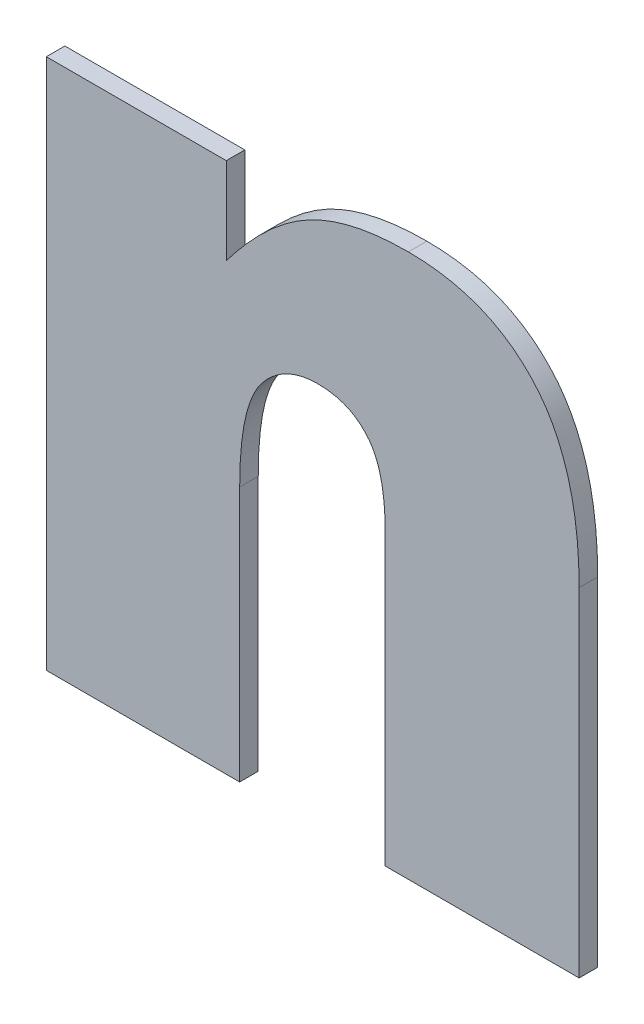
ISO-10303-21;
HEADER;
FILE_DESCRIPTION(('STEP AP214'),'2;1');
FILE_NAME('part.step','',(''),(''),'','','');
FILE_SCHEMA(('AUTOMOTIVE_DESIGN { 1 0 10303 214 1 1 1 1 }'));
ENDSEC;
DATA;
#1=APPLICATION_CONTEXT('core data for automotive mechanical design processes');
#2=APPLICATION_PROTOCOL_DEFINITION('international standard','automotive_design',2000,#1);
#3=PRODUCT_CONTEXT('',#1,'mechanical');
#4=PRODUCT('Part','Part','',(#3));
#5=PRODUCT_RELATED_PRODUCT_CATEGORY('part','',(#4));
#6=PRODUCT_DEFINITION_FORMATION('','',#4);
#7=PRODUCT_DEFINITION_CONTEXT('part definition',#1,'design');
#8=PRODUCT_DEFINITION('design','',#6,#7);
#9=PRODUCT_DEFINITION_SHAPE('','',#8);
#10=(LENGTH_UNIT() NAMED_UNIT(*) SI_UNIT(.MILLI.,.METRE.));
#11=(NAMED_UNIT(*) PLANE_ANGLE_UNIT() SI_UNIT($,.RADIAN.));
#12=(NAMED_UNIT(*) SI_UNIT($,.STERADIAN.) SOLID_ANGLE_UNIT());
#13=UNCERTAINTY_MEASURE_WITH_UNIT(LENGTH_MEASURE(1.E-05),#10,'distance_accuracy_value','');
#14=(GEOMETRIC_REPRESENTATION_CONTEXT(3) GLOBAL_UNCERTAINTY_ASSIGNED_CONTEXT((#13)) GLOBAL_UNIT_ASSIGNED_CONTEXT((#10,
#11,#12)) REPRESENTATION_CONTEXT('',''));
#15=CARTESIAN_POINT('',(0.,0.,0.));
#16=DIRECTION('',(0.,0.,1.));
#17=DIRECTION('',(1.,0.,0.));
#18=AXIS2_PLACEMENT_3D('',#15,#16,#17);
#19=CARTESIAN_POINT('',(0.587675625881754,-0.660492593100787,0.));
#20=CARTESIAN_POINT('',(0.587675625881754,-0.660492593100787,0.003));
#21=CARTESIAN_POINT('',(0.592810563257037,-0.660492569714139,0.));
#22=CARTESIAN_POINT('',(0.592810563257037,-0.660492569714139,0.003));
#23=CARTESIAN_POINT('',(0.598516079892155,-0.667225017176646,0.));
#24=CARTESIAN_POINT('',(0.598516079892155,-0.667225017176646,0.003));
#25=CARTESIAN_POINT('',(0.598516049229844,-0.675326856629752,0.));
#26=CARTESIAN_POINT('',(0.598516049229844,-0.675326856629752,0.003));
#27=B_SPLINE_SURFACE_WITH_KNOTS('',2,1,((#19,#20),(#21,#22),(#23,#24),(#25,#26)),.UNSPECIFIED.,
.F.,.F.,.F.,(3,1,3),(2,2),(-2.,-1.,0.),(0.,0.0003),.UNSPECIFIED.);
#28=CARTESIAN_POINT('',(0.587675625881754,-0.660492593100787,0.));
#29=CARTESIAN_POINT('',(0.592810563257037,-0.660492569714139,0.));
#30=CARTESIAN_POINT('',(0.598516079892155,-0.667225017176646,0.));
#31=CARTESIAN_POINT('',(0.598516049229844,-0.675326856629752,0.));
#32=B_SPLINE_CURVE_WITH_KNOTS('',2,(#28,#29,#30,#31),.UNSPECIFIED.,.F.,.F.,(3,1,3),(-2.,-1.,0.),.UNSPECIFIED.);
#33=CARTESIAN_POINT('',(0.587675625881754,-0.660492593100787,0.));
#34=VERTEX_POINT('',#33);
#35=CARTESIAN_POINT('',(0.598516049229844,-0.675326856629752,0.));
#36=VERTEX_POINT('',#35);
#37=EDGE_CURVE('E11',#34,#36,#32,.T.);
#38=DIRECTION('',(0.,0.,1.));
#39=VECTOR('',#38,1.);
#40=CARTESIAN_POINT('',(0.598516049229844,-0.675326856629752,0.));
#41=LINE('',#40,#39);
#42=CARTESIAN_POINT('',(0.598516049229844,-0.675326856629752,0.003));
#43=VERTEX_POINT('',#42);
#44=EDGE_CURVE('E28',#36,#43,#41,.T.);
#45=CARTESIAN_POINT('',(0.587675625881754,-0.660492593100787,0.003));
#46=CARTESIAN_POINT('',(0.592810563257037,-0.660492569714139,0.003));
#47=CARTESIAN_POINT('',(0.598516079892155,-0.667225017176646,0.003));
#48=CARTESIAN_POINT('',(0.598516049229844,-0.675326856629752,0.003));
#49=B_SPLINE_CURVE_WITH_KNOTS('',2,(#45,#46,#47,#48),.UNSPECIFIED.,.F.,.F.,(3,1,3),(-2.,-1.,0.),.UNSPECIFIED.);
#50=CARTESIAN_POINT('',(0.587675625881754,-0.660492593100787,0.003));
#51=VERTEX_POINT('',#50);
#52=EDGE_CURVE('E128',#51,#43,#49,.T.);
#53=DIRECTION('',(0.,0.,1.));
#54=VECTOR('',#53,1.);
#55=CARTESIAN_POINT('',(0.587675625881754,-0.660492593100787,0.));
#56=LINE('',#55,#54);
#57=EDGE_CURVE('E237',#34,#51,#56,.T.);
#58=ORIENTED_EDGE('',*,*,#37,.T.);
#59=ORIENTED_EDGE('',*,*,#44,.T.);
#60=ORIENTED_EDGE('',*,*,#52,.F.);
#61=ORIENTED_EDGE('',*,*,#57,.F.);
#62=EDGE_LOOP('',(#58,#59,#60,#61));
#63=FACE_BOUND('',#62,.T.);
#64=ADVANCED_FACE('F17',(#63),#27,.T.);
#65=CARTESIAN_POINT('',(0.575009447022407,-0.68126056204134,0.));
#66=CARTESIAN_POINT('',(0.575009447022407,-0.68126056204134,0.003));
#67=CARTESIAN_POINT('',(0.575009447022364,-0.669507260937635,0.));
#68=CARTESIAN_POINT('',(0.575009447022364,-0.669507260937635,0.003));
#69=CARTESIAN_POINT('',(0.58208424962848,-0.660492593100778,0.));
#70=CARTESIAN_POINT('',(0.58208424962848,-0.660492593100778,0.003));
#71=CARTESIAN_POINT('',(0.587675625881754,-0.660492593100787,0.));
#72=CARTESIAN_POINT('',(0.587675625881754,-0.660492593100787,0.003));
#73=B_SPLINE_SURFACE_WITH_KNOTS('',2,1,((#65,#66),(#67,#68),(#69,#70),(#71,#72)),.UNSPECIFIED.,
.F.,.F.,.F.,(3,1,3),(2,2),(-2.,-1.,0.),(0.,0.0003),.UNSPECIFIED.);
#74=CARTESIAN_POINT('',(0.575009447022407,-0.68126056204134,0.));
#75=CARTESIAN_POINT('',(0.575009447022364,-0.669507260937635,0.));
#76=CARTESIAN_POINT('',(0.58208424962848,-0.660492593100778,0.));
#77=CARTESIAN_POINT('',(0.587675625881754,-0.660492593100787,0.));
#78=B_SPLINE_CURVE_WITH_KNOTS('',2,(#74,#75,#76,#77),.UNSPECIFIED.,.F.,.F.,(3,1,3),(-2.,-1.,0.),.UNSPECIFIED.);
#79=CARTESIAN_POINT('',(0.575009447022407,-0.68126056204134,0.));
#80=VERTEX_POINT('',#79);
#81=EDGE_CURVE('E229',#80,#34,#78,.T.);
#82=CARTESIAN_POINT('',(0.575009447022407,-0.68126056204134,0.003));
#83=CARTESIAN_POINT('',(0.575009447022364,-0.669507260937635,0.003));
#84=CARTESIAN_POINT('',(0.58208424962848,-0.660492593100778,0.003));
#85=CARTESIAN_POINT('',(0.587675625881754,-0.660492593100787,0.003));
#86=B_SPLINE_CURVE_WITH_KNOTS('',2,(#82,#83,#84,#85),.UNSPECIFIED.,.F.,.F.,(3,1,3),(-2.,-1.,0.),.UNSPECIFIED.);
#87=CARTESIAN_POINT('',(0.575009447022407,-0.68126056204134,0.003));
#88=VERTEX_POINT('',#87);
#89=EDGE_CURVE('E225',#88,#51,#86,.T.);
#90=DIRECTION('',(0.,0.,1.));
#91=VECTOR('',#90,1.);
#92=CARTESIAN_POINT('',(0.575009447022407,-0.68126056204134,0.));
#93=LINE('',#92,#91);
#94=EDGE_CURVE('E222',#80,#88,#93,.T.);
#95=ORIENTED_EDGE('',*,*,#81,.T.);
#96=ORIENTED_EDGE('',*,*,#57,.T.);
#97=ORIENTED_EDGE('',*,*,#89,.F.);
#98=ORIENTED_EDGE('',*,*,#94,.F.);
#99=EDGE_LOOP('',(#95,#96,#97,#98));
#100=FACE_BOUND('',#99,.T.);
#101=ADVANCED_FACE('F274',(#100),#73,.T.);
#102=CARTESIAN_POINT('',(0.575009447022407,-0.722568280483534,0.));
#103=DIRECTION('',(1.,0.,0.));
#104=DIRECTION('',(0.,1.,0.));
#105=AXIS2_PLACEMENT_3D('',#102,#103,#104);
#106=PLANE('',#105);
#107=DIRECTION('',(0.,1.,0.));
#108=VECTOR('',#107,1.);
#109=CARTESIAN_POINT('',(0.575009447022407,-0.722568280483534,0.));
#110=LINE('',#109,#108);
#111=CARTESIAN_POINT('',(0.575009447022407,-0.722568280483534,0.));
#112=VERTEX_POINT('',#111);
#113=EDGE_CURVE('E219',#112,#80,#110,.T.);
#114=ORIENTED_EDGE('',*,*,#113,.T.);
#115=ORIENTED_EDGE('',*,*,#94,.T.);
#116=DIRECTION('',(0.,1.,0.));
#117=VECTOR('',#116,1.);
#118=CARTESIAN_POINT('',(0.575009447022407,-0.722568280483534,0.003));
#119=LINE('',#118,#117);
#120=CARTESIAN_POINT('',(0.575009447022407,-0.722568280483534,0.003));
#121=VERTEX_POINT('',#120);
#122=EDGE_CURVE('E216',#121,#88,#119,.T.);
#123=ORIENTED_EDGE('',*,*,#122,.F.);
#124=DIRECTION('',(0.,0.,1.));
#125=VECTOR('',#124,1.);
#126=CARTESIAN_POINT('',(0.575009447022407,-0.722568280483534,0.));
#127=LINE('',#126,#125);
#128=EDGE_CURVE('E213',#112,#121,#127,.T.);
#129=ORIENTED_EDGE('',*,*,#128,.F.);
#130=EDGE_LOOP('',(#114,#115,#123,#129));
#131=FACE_BOUND('',#130,.T.);
#132=ADVANCED_FACE('F271',(#131),#106,.T.);
#133=CARTESIAN_POINT('',(0.543743383892126,-0.722568280483534,0.));
#134=DIRECTION('',(0.,-1.,0.));
#135=DIRECTION('',(1.,0.,0.));
#136=AXIS2_PLACEMENT_3D('',#133,#134,#135);
#137=PLANE('',#136);
#138=DIRECTION('',(1.,0.,0.));
#139=VECTOR('',#138,1.);
#140=CARTESIAN_POINT('',(0.543743383892126,-0.722568280483534,0.));
#141=LINE('',#140,#139);
#142=CARTESIAN_POINT('',(0.543743383892126,-0.722568280483534,0.));
#143=VERTEX_POINT('',#142);
#144=EDGE_CURVE('E210',#143,#112,#141,.T.);
#145=ORIENTED_EDGE('',*,*,#144,.T.);
#146=ORIENTED_EDGE('',*,*,#128,.T.);
#147=DIRECTION('',(1.,0.,0.));
#148=VECTOR('',#147,1.);
#149=CARTESIAN_POINT('',(0.543743383892126,-0.722568280483534,0.003));
#150=LINE('',#149,#148);
#151=CARTESIAN_POINT('',(0.543743383892126,-0.722568280483534,0.003));
#152=VERTEX_POINT('',#151);
#153=EDGE_CURVE('E207',#152,#121,#150,.T.);
#154=ORIENTED_EDGE('',*,*,#153,.F.);
#155=DIRECTION('',(0.,0.,1.));
#156=VECTOR('',#155,1.);
#157=CARTESIAN_POINT('',(0.543743383892126,-0.722568280483534,0.));
#158=LINE('',#157,#156);
#159=EDGE_CURVE('E204',#143,#152,#158,.T.);
#160=ORIENTED_EDGE('',*,*,#159,.F.);
#161=EDGE_LOOP('',(#145,#146,#154,#160));
#162=FACE_BOUND('',#161,.T.);
#163=ADVANCED_FACE('F268',(#162),#137,.T.);
#164=CARTESIAN_POINT('',(0.543743383892126,-0.636643661734989,0.));
#165=DIRECTION('',(-1.,0.,0.));
#166=DIRECTION('',(0.,-1.,0.));
#167=AXIS2_PLACEMENT_3D('',#164,#165,#166);
#168=PLANE('',#167);
#169=DIRECTION('',(0.,-1.,0.));
#170=VECTOR('',#169,1.);
#171=CARTESIAN_POINT('',(0.543743383892126,-0.636643661734989,0.));
#172=LINE('',#171,#170);
#173=CARTESIAN_POINT('',(0.543743383892126,-0.636643661734989,0.));
#174=VERTEX_POINT('',#173);
#175=EDGE_CURVE('E201',#174,#143,#172,.T.);
#176=ORIENTED_EDGE('',*,*,#175,.T.);
#177=ORIENTED_EDGE('',*,*,#159,.T.);
#178=DIRECTION('',(0.,-1.,0.));
#179=VECTOR('',#178,1.);
#180=CARTESIAN_POINT('',(0.543743383892126,-0.636643661734989,0.003));
#181=LINE('',#180,#179);
#182=CARTESIAN_POINT('',(0.543743383892126,-0.636643661734989,0.003));
#183=VERTEX_POINT('',#182);
#184=EDGE_CURVE('E198',#183,#152,#181,.T.);
#185=ORIENTED_EDGE('',*,*,#184,.F.);
#186=DIRECTION('',(0.,0.,1.));
#187=VECTOR('',#186,1.);
#188=CARTESIAN_POINT('',(0.543743383892126,-0.636643661734989,0.));
#189=LINE('',#188,#187);
#190=EDGE_CURVE('E195',#174,#183,#189,.T.);
#191=ORIENTED_EDGE('',*,*,#190,.F.);
#192=EDGE_LOOP('',(#176,#177,#185,#191));
#193=FACE_BOUND('',#192,.T.);
#194=ADVANCED_FACE('F265',(#193),#168,.T.);
#195=CARTESIAN_POINT('',(0.572841362352789,-0.636643661734989,0.));
#196=DIRECTION('',(0.,1.,0.));
#197=DIRECTION('',(-1.,0.,0.));
#198=AXIS2_PLACEMENT_3D('',#195,#196,#197);
#199=PLANE('',#198);
#200=DIRECTION('',(-1.,0.,0.));
#201=VECTOR('',#200,1.);
#202=CARTESIAN_POINT('',(0.572841362352789,-0.636643661734989,0.));
#203=LINE('',#202,#201);
#204=CARTESIAN_POINT('',(0.572841362352789,-0.636643661734989,0.));
#205=VERTEX_POINT('',#204);
#206=EDGE_CURVE('E192',#205,#174,#203,.T.);
#207=ORIENTED_EDGE('',*,*,#206,.T.);
#208=ORIENTED_EDGE('',*,*,#190,.T.);
#209=DIRECTION('',(-1.,0.,0.));
#210=VECTOR('',#209,1.);
#211=CARTESIAN_POINT('',(0.572841362352789,-0.636643661734989,0.003));
#212=LINE('',#211,#210);
#213=CARTESIAN_POINT('',(0.572841362352789,-0.636643661734989,0.003));
#214=VERTEX_POINT('',#213);
#215=EDGE_CURVE('E189',#214,#183,#212,.T.);
#216=ORIENTED_EDGE('',*,*,#215,.F.);
#217=DIRECTION('',(0.,0.,1.));
#218=VECTOR('',#217,1.);
#219=CARTESIAN_POINT('',(0.572841362352789,-0.636643661734989,0.));
#220=LINE('',#219,#218);
#221=EDGE_CURVE('E186',#205,#214,#220,.T.);
#222=ORIENTED_EDGE('',*,*,#221,.F.);
#223=EDGE_LOOP('',(#207,#208,#216,#222));
#224=FACE_BOUND('',#223,.T.);
#225=ADVANCED_FACE('F262',(#224),#199,.T.);
#226=CARTESIAN_POINT('',(0.572841362352789,-0.650679157227781,0.));
#227=DIRECTION('',(1.,0.,0.));
#228=DIRECTION('',(0.,1.,0.));
#229=AXIS2_PLACEMENT_3D('',#226,#227,#228);
#230=PLANE('',#229);
#231=DIRECTION('',(0.,1.,0.));
#232=VECTOR('',#231,1.);
#233=CARTESIAN_POINT('',(0.572841362352789,-0.650679157227781,0.));
#234=LINE('',#233,#232);
#235=CARTESIAN_POINT('',(0.572841362352789,-0.650679157227781,0.));
#236=VERTEX_POINT('',#235);
#237=EDGE_CURVE('E183',#236,#205,#234,.T.);
#238=ORIENTED_EDGE('',*,*,#237,.T.);
#239=ORIENTED_EDGE('',*,*,#221,.T.);
#240=DIRECTION('',(0.,1.,0.));
#241=VECTOR('',#240,1.);
#242=CARTESIAN_POINT('',(0.572841362352789,-0.650679157227781,0.003));
#243=LINE('',#242,#241);
#244=CARTESIAN_POINT('',(0.572841362352789,-0.650679157227781,0.003));
#245=VERTEX_POINT('',#244);
#246=EDGE_CURVE('E180',#245,#214,#243,.T.);
#247=ORIENTED_EDGE('',*,*,#246,.F.);
#248=DIRECTION('',(0.,0.,1.));
#249=VECTOR('',#248,1.);
#250=CARTESIAN_POINT('',(0.572841362352789,-0.650679157227781,0.));
#251=LINE('',#250,#249);
#252=EDGE_CURVE('E174',#236,#245,#251,.T.);
#253=ORIENTED_EDGE('',*,*,#252,.F.);
#254=EDGE_LOOP('',(#238,#239,#247,#253));
#255=FACE_BOUND('',#254,.T.);
#256=ADVANCED_FACE('F259',(#255),#230,.T.);
#257=CARTESIAN_POINT('',(0.602281669971812,-0.634703796504277,0.));
#258=CARTESIAN_POINT('',(0.602281669971812,-0.634703796504277,0.003));
#259=CARTESIAN_POINT('',(0.592696453537723,-0.634703796504311,0.));
#260=CARTESIAN_POINT('',(0.592696453537723,-0.634703796504311,0.003));
#261=CARTESIAN_POINT('',(0.579345616361649,-0.642006818549329,0.));
#262=CARTESIAN_POINT('',(0.579345616361649,-0.642006818549329,0.003));
#263=CARTESIAN_POINT('',(0.572841362352789,-0.650679157227781,0.));
#264=CARTESIAN_POINT('',(0.572841362352789,-0.650679157227781,0.003));
#265=B_SPLINE_SURFACE_WITH_KNOTS('',2,1,((#257,#258),(#259,#260),(#261,#262),(#263,#264)),
.UNSPECIFIED.,.F.,.F.,.F.,(3,1,3),(2,2),(-2.,-1.,0.),(0.,0.0003),.UNSPECIFIED.);
#266=CARTESIAN_POINT('',(0.602281669971812,-0.634703796504277,0.));
#267=CARTESIAN_POINT('',(0.592696453537723,-0.634703796504311,0.));
#268=CARTESIAN_POINT('',(0.579345616361649,-0.642006818549329,0.));
#269=CARTESIAN_POINT('',(0.572841362352789,-0.650679157227781,0.));
#270=B_SPLINE_CURVE_WITH_KNOTS('',2,(#266,#267,#268,#269),.UNSPECIFIED.,.F.,.F.,(3,1,3),(-2.,
-1.,0.),.UNSPECIFIED.);
#271=CARTESIAN_POINT('',(0.602281669971812,-0.634703796504277,0.));
#272=VERTEX_POINT('',#271);
#273=EDGE_CURVE('E166',#272,#236,#270,.T.);
#274=CARTESIAN_POINT('',(0.602281669971812,-0.634703796504277,0.003));
#275=CARTESIAN_POINT('',(0.592696453537723,-0.634703796504311,0.003));
#276=CARTESIAN_POINT('',(0.579345616361649,-0.642006818549329,0.003));
#277=CARTESIAN_POINT('',(0.572841362352789,-0.650679157227781,0.003));
#278=B_SPLINE_CURVE_WITH_KNOTS('',2,(#274,#275,#276,#277),.UNSPECIFIED.,.F.,.F.,(3,1,3),(-2.,
-1.,0.),.UNSPECIFIED.);
#279=CARTESIAN_POINT('',(0.602281669971812,-0.634703796504277,0.003));
#280=VERTEX_POINT('',#279);
#281=EDGE_CURVE('E161',#280,#245,#278,.T.);
#282=DIRECTION('',(0.,0.,1.));
#283=VECTOR('',#282,1.);
#284=CARTESIAN_POINT('',(0.602281669971812,-0.634703796504277,0.));
#285=LINE('',#284,#283);
#286=EDGE_CURVE('E155',#272,#280,#285,.T.);
#287=ORIENTED_EDGE('',*,*,#273,.T.);
#288=ORIENTED_EDGE('',*,*,#252,.T.);
#289=ORIENTED_EDGE('',*,*,#281,.F.);
#290=ORIENTED_EDGE('',*,*,#286,.F.);
#291=EDGE_LOOP('',(#287,#288,#289,#290));
#292=FACE_BOUND('',#291,.T.);
#293=ADVANCED_FACE('F256',(#292),#265,.T.);
#294=CARTESIAN_POINT('',(0.629896222079577,-0.667909724865273,0.));
#295=CARTESIAN_POINT('',(0.629896222079577,-0.667909724865273,0.003));
#296=CARTESIAN_POINT('',(0.629896220422306,-0.651021486386116,0.));
#297=CARTESIAN_POINT('',(0.629896220422306,-0.651021486386116,0.003));
#298=CARTESIAN_POINT('',(0.615290174730749,-0.634703797937688,0.));
#299=CARTESIAN_POINT('',(0.615290174730749,-0.634703797937688,0.003));
#300=CARTESIAN_POINT('',(0.602281669971812,-0.634703796504277,0.));
#301=CARTESIAN_POINT('',(0.602281669971812,-0.634703796504277,0.003));
#302=B_SPLINE_SURFACE_WITH_KNOTS('',2,1,((#294,#295),(#296,#297),(#298,#299),(#300,#301)),
.UNSPECIFIED.,.F.,.F.,.F.,(3,1,3),(2,2),(-2.,-1.,0.),(0.,0.0003),.UNSPECIFIED.);
#303=CARTESIAN_POINT('',(0.629896222079577,-0.667909724865273,0.));
#304=CARTESIAN_POINT('',(0.629896220422306,-0.651021486386116,0.));
#305=CARTESIAN_POINT('',(0.615290174730749,-0.634703797937688,0.));
#306=CARTESIAN_POINT('',(0.602281669971812,-0.634703796504277,0.));
#307=B_SPLINE_CURVE_WITH_KNOTS('',2,(#303,#304,#305,#306),.UNSPECIFIED.,.F.,.F.,(3,1,3),(-2.,
-1.,0.),.UNSPECIFIED.);
#308=CARTESIAN_POINT('',(0.629896222079577,-0.667909724865273,0.));
#309=VERTEX_POINT('',#308);
#310=EDGE_CURVE('E147',#309,#272,#307,.T.);
#311=CARTESIAN_POINT('',(0.629896222079577,-0.667909724865273,0.003));
#312=CARTESIAN_POINT('',(0.629896220422306,-0.651021486386116,0.003));
#313=CARTESIAN_POINT('',(0.615290174730749,-0.634703797937688,0.003));
#314=CARTESIAN_POINT('',(0.602281669971812,-0.634703796504277,0.003));
#315=B_SPLINE_CURVE_WITH_KNOTS('',2,(#311,#312,#313,#314),.UNSPECIFIED.,.F.,.F.,(3,1,3),(-2.,
-1.,0.),.UNSPECIFIED.);
#316=CARTESIAN_POINT('',(0.629896222079577,-0.667909724865273,0.003));
#317=VERTEX_POINT('',#316);
#318=EDGE_CURVE('E142',#317,#280,#315,.T.);
#319=DIRECTION('',(0.,0.,1.));
#320=VECTOR('',#319,1.);
#321=CARTESIAN_POINT('',(0.629896222079577,-0.667909724865273,0.));
#322=LINE('',#321,#320);
#323=EDGE_CURVE('E139',#309,#317,#322,.T.);
#324=ORIENTED_EDGE('',*,*,#310,.T.);
#325=ORIENTED_EDGE('',*,*,#286,.T.);
#326=ORIENTED_EDGE('',*,*,#318,.F.);
#327=ORIENTED_EDGE('',*,*,#323,.F.);
#328=EDGE_LOOP('',(#324,#325,#326,#327));
#329=FACE_BOUND('',#328,.T.);
#330=ADVANCED_FACE('F253',(#329),#302,.T.);
#331=CARTESIAN_POINT('',(0.629896222079577,-0.722568280483534,0.));
#332=DIRECTION('',(1.,0.,0.));
#333=DIRECTION('',(0.,1.,0.));
#334=AXIS2_PLACEMENT_3D('',#331,#332,#333);
#335=PLANE('',#334);
#336=DIRECTION('',(0.,1.,0.));
#337=VECTOR('',#336,1.);
#338=CARTESIAN_POINT('',(0.629896222079577,-0.722568280483534,0.));
#339=LINE('',#338,#337);
#340=CARTESIAN_POINT('',(0.629896222079577,-0.722568280483534,0.));
#341=VERTEX_POINT('',#340);
#342=EDGE_CURVE('E136',#341,#309,#339,.T.);
#343=ORIENTED_EDGE('',*,*,#342,.T.);
#344=ORIENTED_EDGE('',*,*,#323,.T.);
#345=DIRECTION('',(0.,1.,0.));
#346=VECTOR('',#345,1.);
#347=CARTESIAN_POINT('',(0.629896222079577,-0.722568280483534,0.003));
#348=LINE('',#347,#346);
#349=CARTESIAN_POINT('',(0.629896222079577,-0.722568280483534,0.003));
#350=VERTEX_POINT('',#349);
#351=EDGE_CURVE('E134',#350,#317,#348,.T.);
#352=ORIENTED_EDGE('',*,*,#351,.F.);
#353=DIRECTION('',(0.,0.,1.));
#354=VECTOR('',#353,1.);
#355=CARTESIAN_POINT('',(0.629896222079577,-0.722568280483534,0.));
#356=LINE('',#355,#354);
#357=EDGE_CURVE('E113',#341,#350,#356,.T.);
#358=ORIENTED_EDGE('',*,*,#357,.F.);
#359=EDGE_LOOP('',(#343,#344,#352,#358));
#360=FACE_BOUND('',#359,.T.);
#361=ADVANCED_FACE('F251',(#360),#335,.T.);
#362=CARTESIAN_POINT('',(0.598516049229844,-0.722568280483534,0.));
#363=DIRECTION('',(0.,-1.,0.));
#364=DIRECTION('',(1.,0.,0.));
#365=AXIS2_PLACEMENT_3D('',#362,#363,#364);
#366=PLANE('',#365);
#367=DIRECTION('',(1.,0.,0.));
#368=VECTOR('',#367,1.);
#369=CARTESIAN_POINT('',(0.598516049229844,-0.722568280483534,0.));
#370=LINE('',#369,#368);
#371=CARTESIAN_POINT('',(0.598516049229844,-0.722568280483534,0.));
#372=VERTEX_POINT('',#371);
#373=EDGE_CURVE('E117',#372,#341,#370,.T.);
#374=ORIENTED_EDGE('',*,*,#373,.T.);
#375=ORIENTED_EDGE('',*,*,#357,.T.);
#376=DIRECTION('',(1.,0.,0.));
#377=VECTOR('',#376,1.);
#378=CARTESIAN_POINT('',(0.598516049229844,-0.722568280483534,0.003));
#379=LINE('',#378,#377);
#380=CARTESIAN_POINT('',(0.598516049229844,-0.722568280483534,0.003));
#381=VERTEX_POINT('',#380);
#382=EDGE_CURVE('E106',#381,#350,#379,.T.);
#383=ORIENTED_EDGE('',*,*,#382,.F.);
#384=DIRECTION('',(0.,0.,1.));
#385=VECTOR('',#384,1.);
#386=CARTESIAN_POINT('',(0.598516049229844,-0.722568280483534,0.));
#387=LINE('',#386,#385);
#388=EDGE_CURVE('E110',#372,#381,#387,.T.);
#389=ORIENTED_EDGE('',*,*,#388,.F.);
#390=EDGE_LOOP('',(#374,#375,#383,#389));
#391=FACE_BOUND('',#390,.T.);
#392=ADVANCED_FACE('F109',(#391),#366,.T.);
#393=CARTESIAN_POINT('',(0.598516049229844,-0.675326856629752,0.));
#394=DIRECTION('',(-1.,0.,0.));
#395=DIRECTION('',(0.,-1.,0.));
#396=AXIS2_PLACEMENT_3D('',#393,#394,#395);
#397=PLANE('',#396);
#398=DIRECTION('',(0.,-1.,0.));
#399=VECTOR('',#398,1.);
#400=CARTESIAN_POINT('',(0.598516049229844,-0.675326856629752,0.));
#401=LINE('',#400,#399);
#402=EDGE_CURVE('E123',#36,#372,#401,.T.);
#403=ORIENTED_EDGE('',*,*,#402,.T.);
#404=ORIENTED_EDGE('',*,*,#388,.T.);
#405=DIRECTION('',(0.,-1.,0.));
#406=VECTOR('',#405,1.);
#407=CARTESIAN_POINT('',(0.598516049229844,-0.675326856629752,0.003));
#408=LINE('',#407,#406);
#409=EDGE_CURVE('E122',#43,#381,#408,.T.);
#410=ORIENTED_EDGE('',*,*,#409,.F.);
#411=ORIENTED_EDGE('',*,*,#44,.F.);
#412=EDGE_LOOP('',(#403,#404,#410,#411));
#413=FACE_BOUND('',#412,.T.);
#414=ADVANCED_FACE('F121',(#413),#397,.T.);
#415=CARTESIAN_POINT('',(0.586819802985852,-0.678636038493905,0.003));
#416=DIRECTION('',(0.,0.,1.));
#417=DIRECTION('',(1.,0.,0.));
#418=AXIS2_PLACEMENT_3D('',#415,#416,#417);
#419=PLANE('',#418);
#420=ORIENTED_EDGE('',*,*,#409,.T.);
#421=ORIENTED_EDGE('',*,*,#382,.T.);
#422=ORIENTED_EDGE('',*,*,#351,.T.);
#423=ORIENTED_EDGE('',*,*,#318,.T.);
#424=ORIENTED_EDGE('',*,*,#281,.T.);
#425=ORIENTED_EDGE('',*,*,#246,.T.);
#426=ORIENTED_EDGE('',*,*,#215,.T.);
#427=ORIENTED_EDGE('',*,*,#184,.T.);
#428=ORIENTED_EDGE('',*,*,#153,.T.);
#429=ORIENTED_EDGE('',*,*,#122,.T.);
#430=ORIENTED_EDGE('',*,*,#89,.T.);
#431=ORIENTED_EDGE('',*,*,#52,.T.);
#432=EDGE_LOOP('',(#420,#421,#422,#423,#424,#425,#426,#427,#428,#429,#430,#431));
#433=FACE_BOUND('',#432,.T.);
#434=ADVANCED_FACE('F126',(#433),#419,.T.);
#435=CARTESIAN_POINT('',(0.586819802985852,-0.678636038493905,0.));
#436=DIRECTION('',(0.,0.,1.));
#437=DIRECTION('',(1.,0.,0.));
#438=AXIS2_PLACEMENT_3D('',#435,#436,#437);
#439=PLANE('',#438);
#440=ORIENTED_EDGE('',*,*,#402,.F.);
#441=ORIENTED_EDGE('',*,*,#37,.F.);
#442=ORIENTED_EDGE('',*,*,#81,.F.);
#443=ORIENTED_EDGE('',*,*,#113,.F.);
#444=ORIENTED_EDGE('',*,*,#144,.F.);
#445=ORIENTED_EDGE('',*,*,#175,.F.);
#446=ORIENTED_EDGE('',*,*,#206,.F.);
#447=ORIENTED_EDGE('',*,*,#237,.F.);
#448=ORIENTED_EDGE('',*,*,#273,.F.);
#449=ORIENTED_EDGE('',*,*,#310,.F.);
#450=ORIENTED_EDGE('',*,*,#342,.F.);
#451=ORIENTED_EDGE('',*,*,#373,.F.);
#452=EDGE_LOOP('',(#440,#441,#442,#443,#444,#445,#446,#447,#448,#449,#450,#451));
#453=FACE_BOUND('',#452,.T.);
#454=ADVANCED_FACE('F248',(#453),#439,.F.);
#455=CLOSED_SHELL('',(#64,#101,#132,#163,#194,#225,#256,#293,#330,#361,#392,#414,#434,#454));
#456=MANIFOLD_SOLID_BREP('B1',#455);
#457=ADVANCED_BREP_SHAPE_REPRESENTATION('',(#18,#456),#14);
#458=SHAPE_DEFINITION_REPRESENTATION(#9,#457);
ENDSEC;
END-ISO-10303-21;
